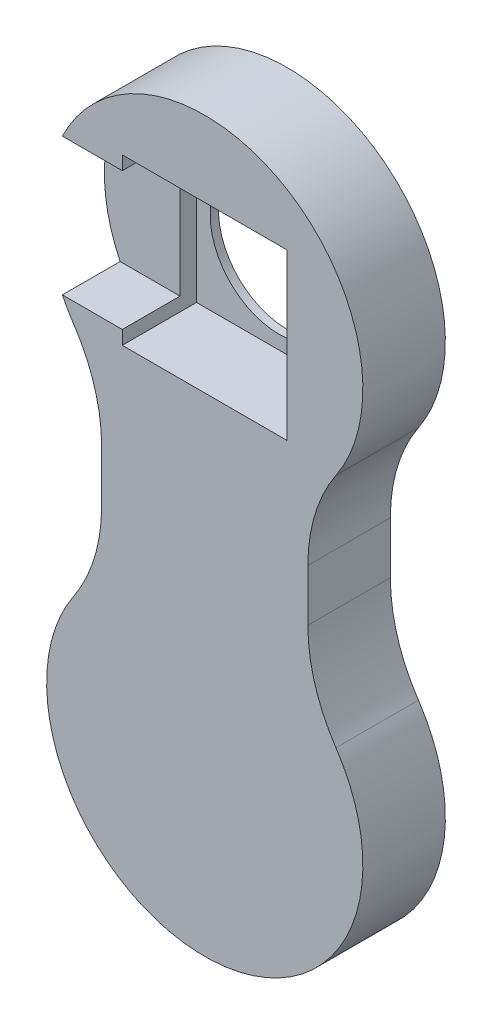
ISO-10303-21;
HEADER;
FILE_DESCRIPTION(('STEP AP214'),'2;1');
FILE_NAME('part.step','',(''),(''),'','','');
FILE_SCHEMA(('AUTOMOTIVE_DESIGN { 1 0 10303 214 1 1 1 1 }'));
ENDSEC;
DATA;
#1=APPLICATION_CONTEXT('core data for automotive mechanical design processes');
#2=APPLICATION_PROTOCOL_DEFINITION('international standard','automotive_design',2000,#1);
#3=PRODUCT_CONTEXT('',#1,'mechanical');
#4=PRODUCT('Part','Part','',(#3));
#5=PRODUCT_RELATED_PRODUCT_CATEGORY('part','',(#4));
#6=PRODUCT_DEFINITION_FORMATION('','',#4);
#7=PRODUCT_DEFINITION_CONTEXT('part definition',#1,'design');
#8=PRODUCT_DEFINITION('design','',#6,#7);
#9=PRODUCT_DEFINITION_SHAPE('','',#8);
#10=(LENGTH_UNIT() NAMED_UNIT(*) SI_UNIT(.MILLI.,.METRE.));
#11=(NAMED_UNIT(*) PLANE_ANGLE_UNIT() SI_UNIT($,.RADIAN.));
#12=(NAMED_UNIT(*) SI_UNIT($,.STERADIAN.) SOLID_ANGLE_UNIT());
#13=UNCERTAINTY_MEASURE_WITH_UNIT(LENGTH_MEASURE(1.E-05),#10,'distance_accuracy_value','');
#14=(GEOMETRIC_REPRESENTATION_CONTEXT(3) GLOBAL_UNCERTAINTY_ASSIGNED_CONTEXT((#13)) GLOBAL_UNIT_ASSIGNED_CONTEXT((#10,
#11,#12)) REPRESENTATION_CONTEXT('',''));
#15=CARTESIAN_POINT('',(0.,0.,0.));
#16=DIRECTION('',(0.,0.,1.));
#17=DIRECTION('',(1.,0.,0.));
#18=AXIS2_PLACEMENT_3D('',#15,#16,#17);
#19=CARTESIAN_POINT('',(1.66533453693773E-13,-2.87276271980974E-13,30.));
#20=DIRECTION('',(0.,0.,1.));
#21=DIRECTION('',(1.,0.,0.));
#22=AXIS2_PLACEMENT_3D('',#19,#20,#21);
#23=PLANE('',#22);
#24=DIRECTION('',(-1.,0.,0.));
#25=VECTOR('',#24,1.);
#26=CARTESIAN_POINT('',(-30.,175.,30.));
#27=LINE('',#26,#25);
#28=CARTESIAN_POINT('',(-30.,175.,30.));
#29=VERTEX_POINT('',#28);
#30=CARTESIAN_POINT('',(-51.7807879430198,175.,30.));
#31=VERTEX_POINT('',#30);
#32=EDGE_CURVE('E157',#29,#31,#27,.T.);
#33=ORIENTED_EDGE('',*,*,#32,.F.);
#34=DIRECTION('',(0.,-1.,0.));
#35=VECTOR('',#34,1.);
#36=CARTESIAN_POINT('',(-30.,120.,30.));
#37=LINE('',#36,#35);
#38=CARTESIAN_POINT('',(-30.,180.,30.));
#39=VERTEX_POINT('',#38);
#40=EDGE_CURVE('E172',#39,#29,#37,.T.);
#41=ORIENTED_EDGE('',*,*,#40,.F.);
#42=DIRECTION('',(-1.,0.,0.));
#43=VECTOR('',#42,1.);
#44=CARTESIAN_POINT('',(30.,180.,30.));
#45=LINE('',#44,#43);
#46=CARTESIAN_POINT('',(30.,180.,30.));
#47=VERTEX_POINT('',#46);
#48=EDGE_CURVE('E184',#47,#39,#45,.T.);
#49=ORIENTED_EDGE('',*,*,#48,.F.);
#50=DIRECTION('',(0.,1.,0.));
#51=VECTOR('',#50,1.);
#52=CARTESIAN_POINT('',(30.,120.,30.));
#53=LINE('',#52,#51);
#54=CARTESIAN_POINT('',(30.,120.,30.));
#55=VERTEX_POINT('',#54);
#56=EDGE_CURVE('E188',#55,#47,#53,.T.);
#57=ORIENTED_EDGE('',*,*,#56,.F.);
#58=DIRECTION('',(1.,0.,0.));
#59=VECTOR('',#58,1.);
#60=CARTESIAN_POINT('',(30.,120.,30.));
#61=LINE('',#60,#59);
#62=CARTESIAN_POINT('',(-30.,120.,30.));
#63=VERTEX_POINT('',#62);
#64=EDGE_CURVE('E62',#63,#55,#61,.T.);
#65=ORIENTED_EDGE('',*,*,#64,.F.);
#66=CARTESIAN_POINT('',(-30.,125.,30.));
#67=VERTEX_POINT('',#66);
#68=EDGE_CURVE('E180',#67,#63,#37,.T.);
#69=ORIENTED_EDGE('',*,*,#68,.F.);
#70=DIRECTION('',(1.,0.,0.));
#71=VECTOR('',#70,1.);
#72=CARTESIAN_POINT('',(-30.,125.,30.));
#73=LINE('',#72,#71);
#74=CARTESIAN_POINT('',(-51.7807879430198,125.,30.));
#75=VERTEX_POINT('',#74);
#76=EDGE_CURVE('E54',#75,#67,#73,.T.);
#77=ORIENTED_EDGE('',*,*,#76,.F.);
#78=CARTESIAN_POINT('',(0.,150.,30.));
#79=DIRECTION('',(0.,0.,1.));
#80=DIRECTION('',(1.,0.,0.));
#81=AXIS2_PLACEMENT_3D('',#78,#79,#80);
#82=CIRCLE('',#81,57.4999999999998);
#83=CARTESIAN_POINT('',(-47.7127659574466,117.910407221501,30.));
#84=VERTEX_POINT('',#83);
#85=EDGE_CURVE('E229',#75,#84,#82,.T.);
#86=ORIENTED_EDGE('',*,*,#85,.T.);
#87=CARTESIAN_POINT('',(-97.4999999999997,84.4256147569799,30.));
#88=DIRECTION('',(0.,0.,1.));
#89=DIRECTION('',(1.,0.,0.));
#90=AXIS2_PLACEMENT_3D('',#87,#88,#89);
#91=CIRCLE('',#90,60.);
#92=CARTESIAN_POINT('',(-37.4999999999997,84.4256147569799,30.));
#93=VERTEX_POINT('',#92);
#94=EDGE_CURVE('E263',#84,#93,#91,.F.);
#95=ORIENTED_EDGE('',*,*,#94,.T.);
#96=DIRECTION('',(0.,-1.,0.));
#97=VECTOR('',#96,1.);
#98=CARTESIAN_POINT('',(-37.4999999999997,-2.87276271980974E-13,30.));
#99=LINE('',#98,#97);
#100=CARTESIAN_POINT('',(-37.4999999999997,65.5743852430196,30.));
#101=VERTEX_POINT('',#100);
#102=EDGE_CURVE('E217',#93,#101,#99,.T.);
#103=ORIENTED_EDGE('',*,*,#102,.T.);
#104=CARTESIAN_POINT('',(-97.4999999999997,65.5743852430196,30.));
#105=DIRECTION('',(0.,0.,1.));
#106=DIRECTION('',(1.,0.,0.));
#107=AXIS2_PLACEMENT_3D('',#104,#105,#106);
#108=CIRCLE('',#107,60.);
#109=CARTESIAN_POINT('',(-47.7127659574465,32.0895927784988,30.));
#110=VERTEX_POINT('',#109);
#111=EDGE_CURVE('E259',#101,#110,#108,.F.);
#112=ORIENTED_EDGE('',*,*,#111,.T.);
#113=CARTESIAN_POINT('',(1.66533453693773E-13,-2.87276271980974E-13,30.));
#114=DIRECTION('',(0.,0.,1.));
#115=DIRECTION('',(1.,0.,0.));
#116=AXIS2_PLACEMENT_3D('',#113,#114,#115);
#117=CIRCLE('',#116,57.4999999999998);
#118=CARTESIAN_POINT('',(47.7127659574467,32.089592778499,30.));
#119=VERTEX_POINT('',#118);
#120=EDGE_CURVE('E226',#110,#119,#117,.T.);
#121=ORIENTED_EDGE('',*,*,#120,.T.);
#122=CARTESIAN_POINT('',(97.4999999999997,65.5743852430201,30.));
#123=DIRECTION('',(0.,0.,1.));
#124=DIRECTION('',(1.,0.,0.));
#125=AXIS2_PLACEMENT_3D('',#122,#123,#124);
#126=CIRCLE('',#125,60.);
#127=CARTESIAN_POINT('',(37.4999999999997,65.5743852430201,30.));
#128=VERTEX_POINT('',#127);
#129=EDGE_CURVE('E267',#119,#128,#126,.F.);
#130=ORIENTED_EDGE('',*,*,#129,.T.);
#131=DIRECTION('',(0.,-1.,0.));
#132=VECTOR('',#131,1.);
#133=CARTESIAN_POINT('',(37.4999999999997,-2.87276271980974E-13,30.));
#134=LINE('',#133,#132);
#135=CARTESIAN_POINT('',(37.4999999999997,84.4256147569799,30.));
#136=VERTEX_POINT('',#135);
#137=EDGE_CURVE('E222',#136,#128,#134,.T.);
#138=ORIENTED_EDGE('',*,*,#137,.F.);
#139=CARTESIAN_POINT('',(97.4999999999997,84.4256147569799,30.));
#140=DIRECTION('',(0.,0.,1.));
#141=DIRECTION('',(1.,0.,0.));
#142=AXIS2_PLACEMENT_3D('',#139,#140,#141);
#143=CIRCLE('',#142,60.);
#144=CARTESIAN_POINT('',(47.7127659574466,117.910407221501,30.));
#145=VERTEX_POINT('',#144);
#146=EDGE_CURVE('E13',#136,#145,#143,.F.);
#147=ORIENTED_EDGE('',*,*,#146,.T.);
#148=EDGE_CURVE('E174',#145,#31,#82,.T.);
#149=ORIENTED_EDGE('',*,*,#148,.T.);
#150=EDGE_LOOP('',(#33,#41,#49,#57,#65,#69,#77,#86,#95,#103,#112,#121,#130,#138,#147,#149));
#151=FACE_BOUND('',#150,.T.);
#152=ADVANCED_FACE('F38',(#151),#23,.T.);
#153=CARTESIAN_POINT('',(1.66533453693773E-13,-2.87276271980974E-13,0.));
#154=DIRECTION('',(0.,0.,1.));
#155=DIRECTION('',(1.,0.,0.));
#156=AXIS2_PLACEMENT_3D('',#153,#154,#155);
#157=PLANE('',#156);
#158=CARTESIAN_POINT('',(0.,150.,0.));
#159=DIRECTION('',(0.,0.,1.));
#160=DIRECTION('',(1.,0.,0.));
#161=AXIS2_PLACEMENT_3D('',#158,#159,#160);
#162=CIRCLE('',#161,25.);
#163=CARTESIAN_POINT('',(25.,150.,0.));
#164=VERTEX_POINT('',#163);
#165=EDGE_CURVE('E210',#164,#164,#162,.T.);
#166=ORIENTED_EDGE('',*,*,#165,.T.);
#167=EDGE_LOOP('',(#166));
#168=FACE_BOUND('',#167,.T.);
#169=CARTESIAN_POINT('',(0.,150.,0.));
#170=DIRECTION('',(0.,0.,1.));
#171=DIRECTION('',(1.,0.,0.));
#172=AXIS2_PLACEMENT_3D('',#169,#170,#171);
#173=CIRCLE('',#172,57.4999999999998);
#174=CARTESIAN_POINT('',(47.7127659574466,117.910407221501,0.));
#175=VERTEX_POINT('',#174);
#176=CARTESIAN_POINT('',(-47.7127659574466,117.910407221501,0.));
#177=VERTEX_POINT('',#176);
#178=EDGE_CURVE('E230',#175,#177,#173,.T.);
#179=ORIENTED_EDGE('',*,*,#178,.F.);
#180=CARTESIAN_POINT('',(97.4999999999997,84.4256147569799,0.));
#181=DIRECTION('',(0.,0.,1.));
#182=DIRECTION('',(1.,0.,0.));
#183=AXIS2_PLACEMENT_3D('',#180,#181,#182);
#184=CIRCLE('',#183,60.);
#185=CARTESIAN_POINT('',(37.4999999999997,84.4256147569799,0.));
#186=VERTEX_POINT('',#185);
#187=EDGE_CURVE('E47',#175,#186,#184,.T.);
#188=ORIENTED_EDGE('',*,*,#187,.T.);
#189=DIRECTION('',(0.,1.,0.));
#190=VECTOR('',#189,1.);
#191=CARTESIAN_POINT('',(37.4999999999997,0.,0.));
#192=LINE('',#191,#190);
#193=CARTESIAN_POINT('',(37.4999999999997,65.5743852430201,0.));
#194=VERTEX_POINT('',#193);
#195=EDGE_CURVE('E214',#194,#186,#192,.T.);
#196=ORIENTED_EDGE('',*,*,#195,.F.);
#197=CARTESIAN_POINT('',(97.4999999999997,65.5743852430201,0.));
#198=DIRECTION('',(0.,0.,1.));
#199=DIRECTION('',(1.,0.,0.));
#200=AXIS2_PLACEMENT_3D('',#197,#198,#199);
#201=CIRCLE('',#200,60.);
#202=CARTESIAN_POINT('',(47.7127659574467,32.089592778499,0.));
#203=VERTEX_POINT('',#202);
#204=EDGE_CURVE('E265',#194,#203,#201,.T.);
#205=ORIENTED_EDGE('',*,*,#204,.T.);
#206=CARTESIAN_POINT('',(1.66533453693773E-13,-2.87276271980974E-13,0.));
#207=DIRECTION('',(0.,0.,1.));
#208=DIRECTION('',(1.,0.,0.));
#209=AXIS2_PLACEMENT_3D('',#206,#207,#208);
#210=CIRCLE('',#209,57.4999999999998);
#211=CARTESIAN_POINT('',(-47.7127659574465,32.0895927784988,0.));
#212=VERTEX_POINT('',#211);
#213=EDGE_CURVE('E225',#212,#203,#210,.T.);
#214=ORIENTED_EDGE('',*,*,#213,.F.);
#215=CARTESIAN_POINT('',(-97.4999999999997,65.5743852430196,0.));
#216=DIRECTION('',(0.,0.,1.));
#217=DIRECTION('',(1.,0.,0.));
#218=AXIS2_PLACEMENT_3D('',#215,#216,#217);
#219=CIRCLE('',#218,60.);
#220=CARTESIAN_POINT('',(-37.4999999999997,65.5743852430196,0.));
#221=VERTEX_POINT('',#220);
#222=EDGE_CURVE('E257',#212,#221,#219,.T.);
#223=ORIENTED_EDGE('',*,*,#222,.T.);
#224=DIRECTION('',(0.,1.,0.));
#225=VECTOR('',#224,1.);
#226=CARTESIAN_POINT('',(-37.4999999999997,0.,0.));
#227=LINE('',#226,#225);
#228=CARTESIAN_POINT('',(-37.4999999999997,84.4256147569799,0.));
#229=VERTEX_POINT('',#228);
#230=EDGE_CURVE('E213',#221,#229,#227,.T.);
#231=ORIENTED_EDGE('',*,*,#230,.T.);
#232=CARTESIAN_POINT('',(-97.4999999999997,84.4256147569799,0.));
#233=DIRECTION('',(0.,0.,1.));
#234=DIRECTION('',(1.,0.,0.));
#235=AXIS2_PLACEMENT_3D('',#232,#233,#234);
#236=CIRCLE('',#235,60.);
#237=EDGE_CURVE('E261',#229,#177,#236,.T.);
#238=ORIENTED_EDGE('',*,*,#237,.T.);
#239=EDGE_LOOP('',(#179,#188,#196,#205,#214,#223,#231,#238));
#240=FACE_BOUND('',#239,.T.);
#241=ADVANCED_FACE('F272',(#168,#240),#157,.F.);
#242=CARTESIAN_POINT('',(1.66533453693773E-13,-2.87276271980974E-13,30.));
#243=DIRECTION('',(0.,0.,-1.));
#244=DIRECTION('',(-1.,0.,0.));
#245=AXIS2_PLACEMENT_3D('',#242,#243,#244);
#246=CYLINDRICAL_SURFACE('',#245,57.4999999999998);
#247=ORIENTED_EDGE('',*,*,#120,.F.);
#248=DIRECTION('',(0.,0.,-1.));
#249=VECTOR('',#248,1.);
#250=CARTESIAN_POINT('',(-47.7127659574465,32.0895927784988,30.));
#251=LINE('',#250,#249);
#252=EDGE_CURVE('E238',#110,#212,#251,.T.);
#253=ORIENTED_EDGE('',*,*,#252,.T.);
#254=ORIENTED_EDGE('',*,*,#213,.T.);
#255=DIRECTION('',(0.,0.,-1.));
#256=VECTOR('',#255,1.);
#257=CARTESIAN_POINT('',(47.7127659574467,32.089592778499,30.));
#258=LINE('',#257,#256);
#259=EDGE_CURVE('E232',#203,#119,#258,.F.);
#260=ORIENTED_EDGE('',*,*,#259,.T.);
#261=EDGE_LOOP('',(#247,#253,#254,#260));
#262=FACE_BOUND('',#261,.T.);
#263=ADVANCED_FACE('F324',(#262),#246,.T.);
#264=CARTESIAN_POINT('',(0.,150.,30.));
#265=DIRECTION('',(0.,0.,-1.));
#266=DIRECTION('',(-1.,0.,0.));
#267=AXIS2_PLACEMENT_3D('',#264,#265,#266);
#268=CYLINDRICAL_SURFACE('',#267,57.4999999999998);
#269=CARTESIAN_POINT('',(0.,150.,9.));
#270=DIRECTION('',(0.,0.,-1.));
#271=DIRECTION('',(-1.,0.,0.));
#272=AXIS2_PLACEMENT_3D('',#269,#270,#271);
#273=CIRCLE('',#272,57.4999999999998);
#274=CARTESIAN_POINT('',(-51.7807879430198,125.,8.99999999999999));
#275=VERTEX_POINT('',#274);
#276=CARTESIAN_POINT('',(-51.7807879430198,175.,8.99999999999999));
#277=VERTEX_POINT('',#276);
#278=EDGE_CURVE('E191',#275,#277,#273,.T.);
#279=ORIENTED_EDGE('',*,*,#278,.T.);
#280=DIRECTION('',(0.,0.,-1.));
#281=VECTOR('',#280,1.);
#282=CARTESIAN_POINT('',(-51.7807879430198,175.,30.));
#283=LINE('',#282,#281);
#284=EDGE_CURVE('E283',#277,#31,#283,.F.);
#285=ORIENTED_EDGE('',*,*,#284,.T.);
#286=ORIENTED_EDGE('',*,*,#148,.F.);
#287=DIRECTION('',(0.,0.,-1.));
#288=VECTOR('',#287,1.);
#289=CARTESIAN_POINT('',(47.7127659574466,117.910407221501,30.));
#290=LINE('',#289,#288);
#291=EDGE_CURVE('E246',#145,#175,#290,.T.);
#292=ORIENTED_EDGE('',*,*,#291,.T.);
#293=ORIENTED_EDGE('',*,*,#178,.T.);
#294=DIRECTION('',(0.,0.,-1.));
#295=VECTOR('',#294,1.);
#296=CARTESIAN_POINT('',(-47.7127659574466,117.910407221501,30.));
#297=LINE('',#296,#295);
#298=EDGE_CURVE('E249',#177,#84,#297,.F.);
#299=ORIENTED_EDGE('',*,*,#298,.T.);
#300=ORIENTED_EDGE('',*,*,#85,.F.);
#301=DIRECTION('',(0.,0.,-1.));
#302=VECTOR('',#301,1.);
#303=CARTESIAN_POINT('',(-51.7807879430198,125.,30.));
#304=LINE('',#303,#302);
#305=EDGE_CURVE('E165',#75,#275,#304,.T.);
#306=ORIENTED_EDGE('',*,*,#305,.T.);
#307=EDGE_LOOP('',(#279,#285,#286,#292,#293,#299,#300,#306));
#308=FACE_BOUND('',#307,.T.);
#309=ADVANCED_FACE('F282',(#308),#268,.T.);
#310=CARTESIAN_POINT('',(-37.4999999999997,0.,35.));
#311=DIRECTION('',(-1.,0.,0.));
#312=DIRECTION('',(0.,0.,1.));
#313=AXIS2_PLACEMENT_3D('',#310,#311,#312);
#314=PLANE('',#313);
#315=ORIENTED_EDGE('',*,*,#230,.F.);
#316=DIRECTION('',(0.,0.,-1.));
#317=VECTOR('',#316,1.);
#318=CARTESIAN_POINT('',(-37.4999999999997,65.5743852430196,35.));
#319=LINE('',#318,#317);
#320=EDGE_CURVE('E244',#221,#101,#319,.F.);
#321=ORIENTED_EDGE('',*,*,#320,.T.);
#322=ORIENTED_EDGE('',*,*,#102,.F.);
#323=DIRECTION('',(0.,0.,-1.));
#324=VECTOR('',#323,1.);
#325=CARTESIAN_POINT('',(-37.4999999999997,84.4256147569799,35.));
#326=LINE('',#325,#324);
#327=EDGE_CURVE('E241',#93,#229,#326,.T.);
#328=ORIENTED_EDGE('',*,*,#327,.T.);
#329=EDGE_LOOP('',(#315,#321,#322,#328));
#330=FACE_BOUND('',#329,.T.);
#331=ADVANCED_FACE('F328',(#330),#314,.T.);
#332=CARTESIAN_POINT('',(37.4999999999997,0.,35.));
#333=DIRECTION('',(-1.,0.,0.));
#334=DIRECTION('',(0.,0.,1.));
#335=AXIS2_PLACEMENT_3D('',#332,#333,#334);
#336=PLANE('',#335);
#337=ORIENTED_EDGE('',*,*,#137,.T.);
#338=DIRECTION('',(0.,0.,1.));
#339=VECTOR('',#338,1.);
#340=CARTESIAN_POINT('',(37.4999999999997,65.5743852430201,0.));
#341=LINE('',#340,#339);
#342=EDGE_CURVE('E254',#128,#194,#341,.F.);
#343=ORIENTED_EDGE('',*,*,#342,.T.);
#344=ORIENTED_EDGE('',*,*,#195,.T.);
#345=DIRECTION('',(0.,0.,1.));
#346=VECTOR('',#345,1.);
#347=CARTESIAN_POINT('',(37.4999999999997,84.4256147569799,30.));
#348=LINE('',#347,#346);
#349=EDGE_CURVE('E252',#186,#136,#348,.T.);
#350=ORIENTED_EDGE('',*,*,#349,.T.);
#351=EDGE_LOOP('',(#337,#343,#344,#350));
#352=FACE_BOUND('',#351,.T.);
#353=ADVANCED_FACE('F277',(#352),#336,.F.);
#354=CARTESIAN_POINT('',(-97.4999999999997,65.5743852430196,30.));
#355=DIRECTION('',(0.,0.,-1.));
#356=DIRECTION('',(-1.,0.,0.));
#357=AXIS2_PLACEMENT_3D('',#354,#355,#356);
#358=CYLINDRICAL_SURFACE('',#357,60.);
#359=ORIENTED_EDGE('',*,*,#111,.F.);
#360=ORIENTED_EDGE('',*,*,#320,.F.);
#361=ORIENTED_EDGE('',*,*,#222,.F.);
#362=ORIENTED_EDGE('',*,*,#252,.F.);
#363=EDGE_LOOP('',(#359,#360,#361,#362));
#364=FACE_BOUND('',#363,.T.);
#365=ADVANCED_FACE('F336',(#364),#358,.F.);
#366=CARTESIAN_POINT('',(-97.4999999999997,84.4256147569799,30.));
#367=DIRECTION('',(0.,0.,-1.));
#368=DIRECTION('',(-1.,0.,0.));
#369=AXIS2_PLACEMENT_3D('',#366,#367,#368);
#370=CYLINDRICAL_SURFACE('',#369,60.);
#371=ORIENTED_EDGE('',*,*,#94,.F.);
#372=ORIENTED_EDGE('',*,*,#298,.F.);
#373=ORIENTED_EDGE('',*,*,#237,.F.);
#374=ORIENTED_EDGE('',*,*,#327,.F.);
#375=EDGE_LOOP('',(#371,#372,#373,#374));
#376=FACE_BOUND('',#375,.T.);
#377=ADVANCED_FACE('F339',(#376),#370,.F.);
#378=CARTESIAN_POINT('',(97.4999999999997,65.5743852430201,30.));
#379=DIRECTION('',(0.,0.,-1.));
#380=DIRECTION('',(-1.,0.,0.));
#381=AXIS2_PLACEMENT_3D('',#378,#379,#380);
#382=CYLINDRICAL_SURFACE('',#381,60.);
#383=ORIENTED_EDGE('',*,*,#129,.F.);
#384=ORIENTED_EDGE('',*,*,#259,.F.);
#385=ORIENTED_EDGE('',*,*,#204,.F.);
#386=ORIENTED_EDGE('',*,*,#342,.F.);
#387=EDGE_LOOP('',(#383,#384,#385,#386));
#388=FACE_BOUND('',#387,.T.);
#389=ADVANCED_FACE('F342',(#388),#382,.F.);
#390=CARTESIAN_POINT('',(97.4999999999997,84.4256147569799,30.));
#391=DIRECTION('',(0.,0.,-1.));
#392=DIRECTION('',(-1.,0.,0.));
#393=AXIS2_PLACEMENT_3D('',#390,#391,#392);
#394=CYLINDRICAL_SURFACE('',#393,60.);
#395=ORIENTED_EDGE('',*,*,#146,.F.);
#396=ORIENTED_EDGE('',*,*,#349,.F.);
#397=ORIENTED_EDGE('',*,*,#187,.F.);
#398=ORIENTED_EDGE('',*,*,#291,.F.);
#399=EDGE_LOOP('',(#395,#396,#397,#398));
#400=FACE_BOUND('',#399,.T.);
#401=ADVANCED_FACE('F40',(#400),#394,.F.);
#402=CARTESIAN_POINT('',(0.,150.,0.));
#403=DIRECTION('',(0.,0.,1.));
#404=DIRECTION('',(1.,0.,0.));
#405=AXIS2_PLACEMENT_3D('',#402,#403,#404);
#406=CYLINDRICAL_SURFACE('',#405,25.);
#407=CARTESIAN_POINT('',(0.,150.,3.));
#408=DIRECTION('',(0.,0.,-1.));
#409=DIRECTION('',(-1.,0.,0.));
#410=AXIS2_PLACEMENT_3D('',#407,#408,#409);
#411=CIRCLE('',#410,25.);
#412=CARTESIAN_POINT('',(-25.,150.,3.));
#413=VERTEX_POINT('',#412);
#414=EDGE_CURVE('E42',#413,#413,#411,.F.);
#415=ORIENTED_EDGE('',*,*,#414,.T.);
#416=EDGE_LOOP('',(#415));
#417=FACE_BOUND('',#416,.T.);
#418=ORIENTED_EDGE('',*,*,#165,.F.);
#419=EDGE_LOOP('',(#418));
#420=FACE_BOUND('',#419,.T.);
#421=ADVANCED_FACE('F317',(#417,#420),#406,.F.);
#422=CARTESIAN_POINT('',(0.,0.,3.));
#423=DIRECTION('',(0.,0.,-1.));
#424=DIRECTION('',(-1.,0.,0.));
#425=AXIS2_PLACEMENT_3D('',#422,#423,#424);
#426=PLANE('',#425);
#427=DIRECTION('',(0.,1.,0.));
#428=VECTOR('',#427,1.);
#429=CARTESIAN_POINT('',(30.,120.,3.));
#430=LINE('',#429,#428);
#431=CARTESIAN_POINT('',(30.,120.,3.));
#432=VERTEX_POINT('',#431);
#433=CARTESIAN_POINT('',(30.,180.,3.));
#434=VERTEX_POINT('',#433);
#435=EDGE_CURVE('E194',#432,#434,#430,.T.);
#436=ORIENTED_EDGE('',*,*,#435,.T.);
#437=DIRECTION('',(-1.,0.,0.));
#438=VECTOR('',#437,1.);
#439=CARTESIAN_POINT('',(30.,180.,3.));
#440=LINE('',#439,#438);
#441=CARTESIAN_POINT('',(-30.,180.,3.));
#442=VERTEX_POINT('',#441);
#443=EDGE_CURVE('E182',#434,#442,#440,.T.);
#444=ORIENTED_EDGE('',*,*,#443,.T.);
#445=DIRECTION('',(0.,-1.,0.));
#446=VECTOR('',#445,1.);
#447=CARTESIAN_POINT('',(-30.,120.,3.));
#448=LINE('',#447,#446);
#449=CARTESIAN_POINT('',(-30.,120.,3.));
#450=VERTEX_POINT('',#449);
#451=EDGE_CURVE('E203',#442,#450,#448,.T.);
#452=ORIENTED_EDGE('',*,*,#451,.T.);
#453=DIRECTION('',(1.,0.,0.));
#454=VECTOR('',#453,1.);
#455=CARTESIAN_POINT('',(30.,120.,3.));
#456=LINE('',#455,#454);
#457=EDGE_CURVE('E199',#450,#432,#456,.T.);
#458=ORIENTED_EDGE('',*,*,#457,.T.);
#459=EDGE_LOOP('',(#436,#444,#452,#458));
#460=FACE_BOUND('',#459,.T.);
#461=ORIENTED_EDGE('',*,*,#414,.F.);
#462=EDGE_LOOP('',(#461));
#463=FACE_BOUND('',#462,.T.);
#464=ADVANCED_FACE('F306',(#460,#463),#426,.F.);
#465=CARTESIAN_POINT('',(30.,180.,-81.8528137423857));
#466=DIRECTION('',(0.,1.,0.));
#467=DIRECTION('',(0.,0.,1.));
#468=AXIS2_PLACEMENT_3D('',#465,#466,#467);
#469=PLANE('',#468);
#470=DIRECTION('',(0.,0.,1.));
#471=VECTOR('',#470,1.);
#472=CARTESIAN_POINT('',(30.,180.,-81.8528137423857));
#473=LINE('',#472,#471);
#474=EDGE_CURVE('E197',#434,#47,#473,.T.);
#475=ORIENTED_EDGE('',*,*,#474,.T.);
#476=ORIENTED_EDGE('',*,*,#48,.T.);
#477=DIRECTION('',(0.,0.,1.));
#478=VECTOR('',#477,1.);
#479=CARTESIAN_POINT('',(-30.,180.,-81.8528137423857));
#480=LINE('',#479,#478);
#481=EDGE_CURVE('E178',#442,#39,#480,.T.);
#482=ORIENTED_EDGE('',*,*,#481,.F.);
#483=ORIENTED_EDGE('',*,*,#443,.F.);
#484=EDGE_LOOP('',(#475,#476,#482,#483));
#485=FACE_BOUND('',#484,.T.);
#486=ADVANCED_FACE('F309',(#485),#469,.F.);
#487=CARTESIAN_POINT('',(-30.,120.,-81.8528137423857));
#488=DIRECTION('',(-1.,0.,0.));
#489=DIRECTION('',(0.,0.,1.));
#490=AXIS2_PLACEMENT_3D('',#487,#488,#489);
#491=PLANE('',#490);
#492=ORIENTED_EDGE('',*,*,#40,.T.);
#493=DIRECTION('',(0.,0.,1.));
#494=VECTOR('',#493,1.);
#495=CARTESIAN_POINT('',(-30.,175.,-54.0635610525664));
#496=LINE('',#495,#494);
#497=CARTESIAN_POINT('',(-30.,175.,8.99999999999999));
#498=VERTEX_POINT('',#497);
#499=EDGE_CURVE('E153',#498,#29,#496,.T.);
#500=ORIENTED_EDGE('',*,*,#499,.F.);
#501=DIRECTION('',(0.,1.,0.));
#502=VECTOR('',#501,1.);
#503=CARTESIAN_POINT('',(-30.,175.,8.99999999999999));
#504=LINE('',#503,#502);
#505=CARTESIAN_POINT('',(-30.,125.,8.99999999999999));
#506=VERTEX_POINT('',#505);
#507=EDGE_CURVE('E166',#506,#498,#504,.T.);
#508=ORIENTED_EDGE('',*,*,#507,.F.);
#509=DIRECTION('',(0.,0.,1.));
#510=VECTOR('',#509,1.);
#511=CARTESIAN_POINT('',(-30.,125.,-54.0635610525664));
#512=LINE('',#511,#510);
#513=EDGE_CURVE('E288',#506,#67,#512,.T.);
#514=ORIENTED_EDGE('',*,*,#513,.T.);
#515=ORIENTED_EDGE('',*,*,#68,.T.);
#516=DIRECTION('',(0.,0.,1.));
#517=VECTOR('',#516,1.);
#518=CARTESIAN_POINT('',(-30.,120.,-81.8528137423857));
#519=LINE('',#518,#517);
#520=EDGE_CURVE('E202',#450,#63,#519,.T.);
#521=ORIENTED_EDGE('',*,*,#520,.F.);
#522=ORIENTED_EDGE('',*,*,#451,.F.);
#523=ORIENTED_EDGE('',*,*,#481,.T.);
#524=EDGE_LOOP('',(#492,#500,#508,#514,#515,#521,#522,#523));
#525=FACE_BOUND('',#524,.T.);
#526=ADVANCED_FACE('F176',(#525),#491,.F.);
#527=CARTESIAN_POINT('',(30.,120.,-81.8528137423857));
#528=DIRECTION('',(0.,-1.,0.));
#529=DIRECTION('',(0.,0.,-1.));
#530=AXIS2_PLACEMENT_3D('',#527,#528,#529);
#531=PLANE('',#530);
#532=ORIENTED_EDGE('',*,*,#520,.T.);
#533=ORIENTED_EDGE('',*,*,#64,.T.);
#534=DIRECTION('',(0.,0.,1.));
#535=VECTOR('',#534,1.);
#536=CARTESIAN_POINT('',(30.,120.,-81.8528137423857));
#537=LINE('',#536,#535);
#538=EDGE_CURVE('E198',#432,#55,#537,.T.);
#539=ORIENTED_EDGE('',*,*,#538,.F.);
#540=ORIENTED_EDGE('',*,*,#457,.F.);
#541=EDGE_LOOP('',(#532,#533,#539,#540));
#542=FACE_BOUND('',#541,.T.);
#543=ADVANCED_FACE('F304',(#542),#531,.F.);
#544=CARTESIAN_POINT('',(30.,120.,-81.8528137423857));
#545=DIRECTION('',(1.,0.,0.));
#546=DIRECTION('',(0.,0.,-1.));
#547=AXIS2_PLACEMENT_3D('',#544,#545,#546);
#548=PLANE('',#547);
#549=ORIENTED_EDGE('',*,*,#538,.T.);
#550=ORIENTED_EDGE('',*,*,#56,.T.);
#551=ORIENTED_EDGE('',*,*,#474,.F.);
#552=ORIENTED_EDGE('',*,*,#435,.F.);
#553=EDGE_LOOP('',(#549,#550,#551,#552));
#554=FACE_BOUND('',#553,.T.);
#555=ADVANCED_FACE('F303',(#554),#548,.F.);
#556=CARTESIAN_POINT('',(0.,0.,9.));
#557=DIRECTION('',(0.,0.,-1.));
#558=DIRECTION('',(-1.,0.,0.));
#559=AXIS2_PLACEMENT_3D('',#556,#557,#558);
#560=PLANE('',#559);
#561=ORIENTED_EDGE('',*,*,#278,.F.);
#562=DIRECTION('',(1.,0.,0.));
#563=VECTOR('',#562,1.);
#564=CARTESIAN_POINT('',(-30.,125.,8.99999999999999));
#565=LINE('',#564,#563);
#566=EDGE_CURVE('E290',#275,#506,#565,.T.);
#567=ORIENTED_EDGE('',*,*,#566,.T.);
#568=ORIENTED_EDGE('',*,*,#507,.T.);
#569=DIRECTION('',(-1.,0.,0.));
#570=VECTOR('',#569,1.);
#571=CARTESIAN_POINT('',(-30.,175.,8.99999999999999));
#572=LINE('',#571,#570);
#573=EDGE_CURVE('E160',#498,#277,#572,.T.);
#574=ORIENTED_EDGE('',*,*,#573,.T.);
#575=EDGE_LOOP('',(#561,#567,#568,#574));
#576=FACE_BOUND('',#575,.T.);
#577=ADVANCED_FACE('F295',(#576),#560,.F.);
#578=CARTESIAN_POINT('',(-30.,175.,-54.0635610525664));
#579=DIRECTION('',(0.,1.,0.));
#580=DIRECTION('',(0.,0.,1.));
#581=AXIS2_PLACEMENT_3D('',#578,#579,#580);
#582=PLANE('',#581);
#583=ORIENTED_EDGE('',*,*,#573,.F.);
#584=ORIENTED_EDGE('',*,*,#499,.T.);
#585=ORIENTED_EDGE('',*,*,#32,.T.);
#586=ORIENTED_EDGE('',*,*,#284,.F.);
#587=EDGE_LOOP('',(#583,#584,#585,#586));
#588=FACE_BOUND('',#587,.T.);
#589=ADVANCED_FACE('F155',(#588),#582,.F.);
#590=CARTESIAN_POINT('',(-30.,125.,-54.0635610525664));
#591=DIRECTION('',(0.,-1.,0.));
#592=DIRECTION('',(0.,0.,-1.));
#593=AXIS2_PLACEMENT_3D('',#590,#591,#592);
#594=PLANE('',#593);
#595=ORIENTED_EDGE('',*,*,#76,.T.);
#596=ORIENTED_EDGE('',*,*,#513,.F.);
#597=ORIENTED_EDGE('',*,*,#566,.F.);
#598=ORIENTED_EDGE('',*,*,#305,.F.);
#599=EDGE_LOOP('',(#595,#596,#597,#598));
#600=FACE_BOUND('',#599,.T.);
#601=ADVANCED_FACE('F362',(#600),#594,.F.);
#602=CLOSED_SHELL('',(#152,#241,#263,#309,#331,#353,#365,#377,#389,#401,#421,#464,#486,#526,
#543,#555,#577,#589,#601));
#603=MANIFOLD_SOLID_BREP('B2',#602);
#604=ADVANCED_BREP_SHAPE_REPRESENTATION('',(#18,#603),#14);
#605=SHAPE_DEFINITION_REPRESENTATION(#9,#604);
ENDSEC;
END-ISO-10303-21;
